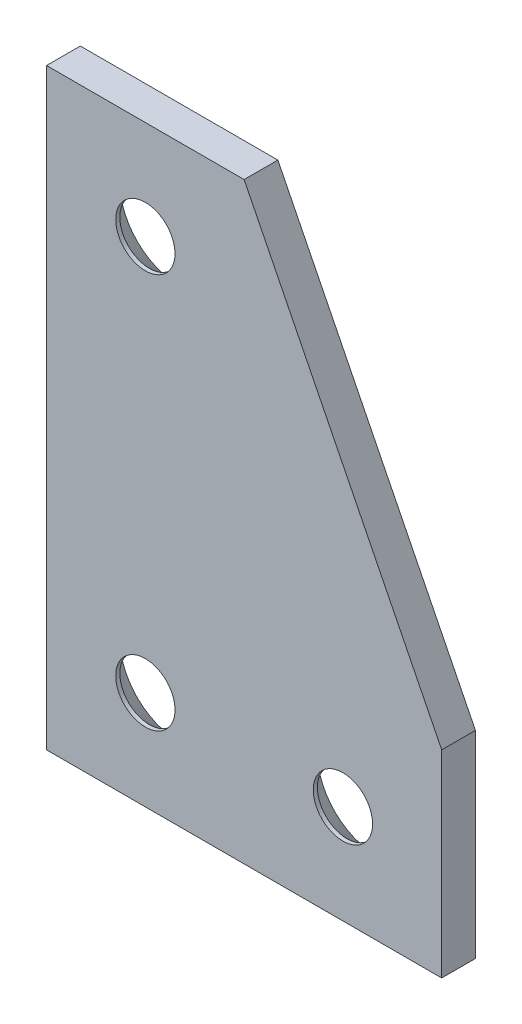
ISO-10303-21;
HEADER;
FILE_DESCRIPTION(('STEP AP214'),'2;1');
FILE_NAME('part.step','',(''),(''),'','','');
FILE_SCHEMA(('AUTOMOTIVE_DESIGN { 1 0 10303 214 1 1 1 1 }'));
ENDSEC;
DATA;
#1=APPLICATION_CONTEXT('core data for automotive mechanical design processes');
#2=APPLICATION_PROTOCOL_DEFINITION('international standard','automotive_design',2000,#1);
#3=PRODUCT_CONTEXT('',#1,'mechanical');
#4=PRODUCT('Part','Part','',(#3));
#5=PRODUCT_RELATED_PRODUCT_CATEGORY('part','',(#4));
#6=PRODUCT_DEFINITION_FORMATION('','',#4);
#7=PRODUCT_DEFINITION_CONTEXT('part definition',#1,'design');
#8=PRODUCT_DEFINITION('design','',#6,#7);
#9=PRODUCT_DEFINITION_SHAPE('','',#8);
#10=(LENGTH_UNIT() NAMED_UNIT(*) SI_UNIT(.MILLI.,.METRE.));
#11=(NAMED_UNIT(*) PLANE_ANGLE_UNIT() SI_UNIT($,.RADIAN.));
#12=(NAMED_UNIT(*) SI_UNIT($,.STERADIAN.) SOLID_ANGLE_UNIT());
#13=UNCERTAINTY_MEASURE_WITH_UNIT(LENGTH_MEASURE(1.E-05),#10,'distance_accuracy_value','');
#14=(GEOMETRIC_REPRESENTATION_CONTEXT(3) GLOBAL_UNCERTAINTY_ASSIGNED_CONTEXT((#13)) GLOBAL_UNIT_ASSIGNED_CONTEXT((#10,
#11,#12)) REPRESENTATION_CONTEXT('',''));
#15=CARTESIAN_POINT('',(0.,0.,0.));
#16=DIRECTION('',(0.,0.,1.));
#17=DIRECTION('',(1.,0.,0.));
#18=AXIS2_PLACEMENT_3D('',#15,#16,#17);
#19=CARTESIAN_POINT('',(0.,30.,-1.708));
#20=DIRECTION('',(-0.894427190999916,-0.447213595499958,0.));
#21=DIRECTION('',(0.447213595499958,-0.894427190999916,0.));
#22=AXIS2_PLACEMENT_3D('',#19,#20,#21);
#23=PLANE('',#22);
#24=DIRECTION('',(-0.447213595499958,0.894427190999916,0.));
#25=VECTOR('',#24,1.);
#26=CARTESIAN_POINT('',(0.,30.,1.708));
#27=LINE('',#26,#25);
#28=CARTESIAN_POINT('',(20.,-9.99999999999999,1.708));
#29=VERTEX_POINT('',#28);
#30=CARTESIAN_POINT('',(0.,30.,1.708));
#31=VERTEX_POINT('',#30);
#32=EDGE_CURVE('E118',#29,#31,#27,.T.);
#33=ORIENTED_EDGE('',*,*,#32,.F.);
#34=DIRECTION('',(0.,0.,1.));
#35=VECTOR('',#34,1.);
#36=CARTESIAN_POINT('',(20.,-9.99999999999999,-1.708));
#37=LINE('',#36,#35);
#38=CARTESIAN_POINT('',(20.,-9.99999999999999,-1.708));
#39=VERTEX_POINT('',#38);
#40=EDGE_CURVE('E117',#39,#29,#37,.T.);
#41=ORIENTED_EDGE('',*,*,#40,.F.);
#42=DIRECTION('',(-0.447213595499958,0.894427190999916,0.));
#43=VECTOR('',#42,1.);
#44=CARTESIAN_POINT('',(0.,30.,-1.708));
#45=LINE('',#44,#43);
#46=CARTESIAN_POINT('',(0.,30.,-1.708));
#47=VERTEX_POINT('',#46);
#48=EDGE_CURVE('E112',#39,#47,#45,.T.);
#49=ORIENTED_EDGE('',*,*,#48,.T.);
#50=DIRECTION('',(0.,0.,1.));
#51=VECTOR('',#50,1.);
#52=CARTESIAN_POINT('',(0.,30.,-1.708));
#53=LINE('',#52,#51);
#54=EDGE_CURVE('E131',#47,#31,#53,.T.);
#55=ORIENTED_EDGE('',*,*,#54,.T.);
#56=EDGE_LOOP('',(#33,#41,#49,#55));
#57=FACE_BOUND('',#56,.T.);
#58=ADVANCED_FACE('F41',(#57),#23,.F.);
#59=CARTESIAN_POINT('',(-20.,30.,-1.708));
#60=DIRECTION('',(0.,-1.,0.));
#61=DIRECTION('',(0.,0.,1.));
#62=AXIS2_PLACEMENT_3D('',#59,#60,#61);
#63=PLANE('',#62);
#64=DIRECTION('',(-1.,0.,0.));
#65=VECTOR('',#64,1.);
#66=CARTESIAN_POINT('',(-20.,30.,1.708));
#67=LINE('',#66,#65);
#68=CARTESIAN_POINT('',(-20.,30.,1.708));
#69=VERTEX_POINT('',#68);
#70=EDGE_CURVE('E120',#31,#69,#67,.T.);
#71=ORIENTED_EDGE('',*,*,#70,.F.);
#72=ORIENTED_EDGE('',*,*,#54,.F.);
#73=DIRECTION('',(-1.,0.,0.));
#74=VECTOR('',#73,1.);
#75=CARTESIAN_POINT('',(-20.,30.,-1.708));
#76=LINE('',#75,#74);
#77=CARTESIAN_POINT('',(-20.,30.,-1.708));
#78=VERTEX_POINT('',#77);
#79=EDGE_CURVE('E87',#47,#78,#76,.T.);
#80=ORIENTED_EDGE('',*,*,#79,.T.);
#81=DIRECTION('',(0.,0.,1.));
#82=VECTOR('',#81,1.);
#83=CARTESIAN_POINT('',(-20.,30.,-1.708));
#84=LINE('',#83,#82);
#85=EDGE_CURVE('E106',#78,#69,#84,.T.);
#86=ORIENTED_EDGE('',*,*,#85,.T.);
#87=EDGE_LOOP('',(#71,#72,#80,#86));
#88=FACE_BOUND('',#87,.T.);
#89=ADVANCED_FACE('F183',(#88),#63,.F.);
#90=CARTESIAN_POINT('',(-20.,-30.,-1.708));
#91=DIRECTION('',(1.,0.,0.));
#92=DIRECTION('',(0.,0.,1.));
#93=AXIS2_PLACEMENT_3D('',#90,#91,#92);
#94=PLANE('',#93);
#95=DIRECTION('',(0.,-1.,0.));
#96=VECTOR('',#95,1.);
#97=CARTESIAN_POINT('',(-20.,-30.,1.708));
#98=LINE('',#97,#96);
#99=CARTESIAN_POINT('',(-20.,-30.,1.708));
#100=VERTEX_POINT('',#99);
#101=EDGE_CURVE('E124',#69,#100,#98,.T.);
#102=ORIENTED_EDGE('',*,*,#101,.F.);
#103=ORIENTED_EDGE('',*,*,#85,.F.);
#104=DIRECTION('',(0.,-1.,0.));
#105=VECTOR('',#104,1.);
#106=CARTESIAN_POINT('',(-20.,-30.,-1.708));
#107=LINE('',#106,#105);
#108=CARTESIAN_POINT('',(-20.,-30.,-1.708));
#109=VERTEX_POINT('',#108);
#110=EDGE_CURVE('E96',#78,#109,#107,.T.);
#111=ORIENTED_EDGE('',*,*,#110,.T.);
#112=DIRECTION('',(0.,0.,1.));
#113=VECTOR('',#112,1.);
#114=CARTESIAN_POINT('',(-20.,-30.,-1.708));
#115=LINE('',#114,#113);
#116=EDGE_CURVE('E101',#109,#100,#115,.T.);
#117=ORIENTED_EDGE('',*,*,#116,.T.);
#118=EDGE_LOOP('',(#102,#103,#111,#117));
#119=FACE_BOUND('',#118,.T.);
#120=ADVANCED_FACE('F109',(#119),#94,.F.);
#121=CARTESIAN_POINT('',(-20.,-30.,-1.708));
#122=DIRECTION('',(0.,1.,0.));
#123=DIRECTION('',(-1.,0.,0.));
#124=AXIS2_PLACEMENT_3D('',#121,#122,#123);
#125=PLANE('',#124);
#126=DIRECTION('',(1.,0.,0.));
#127=VECTOR('',#126,1.);
#128=CARTESIAN_POINT('',(-20.,-30.,1.708));
#129=LINE('',#128,#127);
#130=CARTESIAN_POINT('',(20.,-30.,1.708));
#131=VERTEX_POINT('',#130);
#132=EDGE_CURVE('E103',#100,#131,#129,.T.);
#133=ORIENTED_EDGE('',*,*,#132,.F.);
#134=ORIENTED_EDGE('',*,*,#116,.F.);
#135=DIRECTION('',(1.,0.,0.));
#136=VECTOR('',#135,1.);
#137=CARTESIAN_POINT('',(-20.,-30.,-1.708));
#138=LINE('',#137,#136);
#139=CARTESIAN_POINT('',(20.,-30.,-1.708));
#140=VERTEX_POINT('',#139);
#141=EDGE_CURVE('E92',#109,#140,#138,.T.);
#142=ORIENTED_EDGE('',*,*,#141,.T.);
#143=DIRECTION('',(0.,0.,1.));
#144=VECTOR('',#143,1.);
#145=CARTESIAN_POINT('',(20.,-30.,-1.708));
#146=LINE('',#145,#144);
#147=EDGE_CURVE('E107',#140,#131,#146,.T.);
#148=ORIENTED_EDGE('',*,*,#147,.T.);
#149=EDGE_LOOP('',(#133,#134,#142,#148));
#150=FACE_BOUND('',#149,.T.);
#151=ADVANCED_FACE('F102',(#150),#125,.F.);
#152=CARTESIAN_POINT('',(20.,-30.,-1.708));
#153=DIRECTION('',(-1.,0.,0.));
#154=DIRECTION('',(0.,-1.,0.));
#155=AXIS2_PLACEMENT_3D('',#152,#153,#154);
#156=PLANE('',#155);
#157=DIRECTION('',(0.,1.,0.));
#158=VECTOR('',#157,1.);
#159=CARTESIAN_POINT('',(20.,-30.,1.708));
#160=LINE('',#159,#158);
#161=EDGE_CURVE('E75',#131,#29,#160,.T.);
#162=ORIENTED_EDGE('',*,*,#161,.F.);
#163=ORIENTED_EDGE('',*,*,#147,.F.);
#164=DIRECTION('',(0.,1.,0.));
#165=VECTOR('',#164,1.);
#166=CARTESIAN_POINT('',(20.,-30.,-1.708));
#167=LINE('',#166,#165);
#168=EDGE_CURVE('E58',#140,#39,#167,.T.);
#169=ORIENTED_EDGE('',*,*,#168,.T.);
#170=ORIENTED_EDGE('',*,*,#40,.T.);
#171=EDGE_LOOP('',(#162,#163,#169,#170));
#172=FACE_BOUND('',#171,.T.);
#173=ADVANCED_FACE('F170',(#172),#156,.F.);
#174=CARTESIAN_POINT('',(0.,0.,-1.708));
#175=DIRECTION('',(0.,0.,-1.));
#176=DIRECTION('',(1.,0.,0.));
#177=AXIS2_PLACEMENT_3D('',#174,#175,#176);
#178=PLANE('',#177);
#179=CARTESIAN_POINT('',(10.,-20.,-1.708));
#180=DIRECTION('',(0.,0.,1.));
#181=DIRECTION('',(1.,0.,0.));
#182=AXIS2_PLACEMENT_3D('',#179,#180,#181);
#183=CIRCLE('',#182,6.00000000000001);
#184=CARTESIAN_POINT('',(16.,-20.,-1.708));
#185=VERTEX_POINT('',#184);
#186=EDGE_CURVE('E143',#185,#185,#183,.F.);
#187=ORIENTED_EDGE('',*,*,#186,.F.);
#188=EDGE_LOOP('',(#187));
#189=FACE_BOUND('',#188,.T.);
#190=CARTESIAN_POINT('',(-9.99999999999999,-20.,-1.708));
#191=DIRECTION('',(0.,0.,1.));
#192=DIRECTION('',(1.,0.,0.));
#193=AXIS2_PLACEMENT_3D('',#190,#191,#192);
#194=CIRCLE('',#193,6.00000000000001);
#195=CARTESIAN_POINT('',(-3.99999999999998,-20.,-1.708));
#196=VERTEX_POINT('',#195);
#197=EDGE_CURVE('E140',#196,#196,#194,.F.);
#198=ORIENTED_EDGE('',*,*,#197,.F.);
#199=EDGE_LOOP('',(#198));
#200=FACE_BOUND('',#199,.T.);
#201=CARTESIAN_POINT('',(-10.,20.,-1.708));
#202=DIRECTION('',(0.,0.,1.));
#203=DIRECTION('',(1.,0.,0.));
#204=AXIS2_PLACEMENT_3D('',#201,#202,#203);
#205=CIRCLE('',#204,6.00000000000001);
#206=CARTESIAN_POINT('',(-3.99999999999999,20.,-1.708));
#207=VERTEX_POINT('',#206);
#208=EDGE_CURVE('E137',#207,#207,#205,.F.);
#209=ORIENTED_EDGE('',*,*,#208,.F.);
#210=EDGE_LOOP('',(#209));
#211=FACE_BOUND('',#210,.T.);
#212=ORIENTED_EDGE('',*,*,#48,.F.);
#213=ORIENTED_EDGE('',*,*,#168,.F.);
#214=ORIENTED_EDGE('',*,*,#141,.F.);
#215=ORIENTED_EDGE('',*,*,#110,.F.);
#216=ORIENTED_EDGE('',*,*,#79,.F.);
#217=EDGE_LOOP('',(#212,#213,#214,#215,#216));
#218=FACE_BOUND('',#217,.T.);
#219=ADVANCED_FACE('F94',(#189,#200,#211,#218),#178,.T.);
#220=CARTESIAN_POINT('',(0.,0.,1.708));
#221=DIRECTION('',(0.,0.,-1.));
#222=DIRECTION('',(1.,0.,0.));
#223=AXIS2_PLACEMENT_3D('',#220,#221,#222);
#224=PLANE('',#223);
#225=CARTESIAN_POINT('',(-10.,20.,1.708));
#226=DIRECTION('',(0.,0.,1.));
#227=DIRECTION('',(1.,0.,0.));
#228=AXIS2_PLACEMENT_3D('',#225,#226,#227);
#229=CIRCLE('',#228,3.);
#230=CARTESIAN_POINT('',(-7.,20.,1.708));
#231=VERTEX_POINT('',#230);
#232=EDGE_CURVE('E121',#231,#231,#229,.T.);
#233=ORIENTED_EDGE('',*,*,#232,.F.);
#234=EDGE_LOOP('',(#233));
#235=FACE_BOUND('',#234,.T.);
#236=CARTESIAN_POINT('',(-9.99999999999999,-20.,1.708));
#237=DIRECTION('',(0.,0.,1.));
#238=DIRECTION('',(1.,0.,0.));
#239=AXIS2_PLACEMENT_3D('',#236,#237,#238);
#240=CIRCLE('',#239,3.);
#241=CARTESIAN_POINT('',(-7.,-20.,1.708));
#242=VERTEX_POINT('',#241);
#243=EDGE_CURVE('E158',#242,#242,#240,.T.);
#244=ORIENTED_EDGE('',*,*,#243,.F.);
#245=EDGE_LOOP('',(#244));
#246=FACE_BOUND('',#245,.T.);
#247=CARTESIAN_POINT('',(10.,-20.,1.708));
#248=DIRECTION('',(0.,0.,1.));
#249=DIRECTION('',(1.,0.,0.));
#250=AXIS2_PLACEMENT_3D('',#247,#248,#249);
#251=CIRCLE('',#250,3.);
#252=CARTESIAN_POINT('',(13.,-20.,1.708));
#253=VERTEX_POINT('',#252);
#254=EDGE_CURVE('E160',#253,#253,#251,.T.);
#255=ORIENTED_EDGE('',*,*,#254,.F.);
#256=EDGE_LOOP('',(#255));
#257=FACE_BOUND('',#256,.T.);
#258=ORIENTED_EDGE('',*,*,#32,.T.);
#259=ORIENTED_EDGE('',*,*,#70,.T.);
#260=ORIENTED_EDGE('',*,*,#101,.T.);
#261=ORIENTED_EDGE('',*,*,#132,.T.);
#262=ORIENTED_EDGE('',*,*,#161,.T.);
#263=EDGE_LOOP('',(#258,#259,#260,#261,#262));
#264=FACE_BOUND('',#263,.T.);
#265=ADVANCED_FACE('F177',(#235,#246,#257,#264),#224,.F.);
#266=CARTESIAN_POINT('',(10.,-20.,1.708));
#267=DIRECTION('',(0.,0.,-1.));
#268=DIRECTION('',(1.,0.,0.));
#269=AXIS2_PLACEMENT_3D('',#266,#267,#268);
#270=CYLINDRICAL_SURFACE('',#269,3.);
#271=CARTESIAN_POINT('',(10.,-20.,1.292));
#272=DIRECTION('',(0.,0.,1.));
#273=DIRECTION('',(1.,0.,0.));
#274=AXIS2_PLACEMENT_3D('',#271,#272,#273);
#275=CIRCLE('',#274,3.);
#276=CARTESIAN_POINT('',(13.,-20.,1.292));
#277=VERTEX_POINT('',#276);
#278=EDGE_CURVE('E134',#277,#277,#275,.T.);
#279=ORIENTED_EDGE('',*,*,#278,.F.);
#280=EDGE_LOOP('',(#279));
#281=FACE_BOUND('',#280,.T.);
#282=ORIENTED_EDGE('',*,*,#254,.T.);
#283=EDGE_LOOP('',(#282));
#284=FACE_BOUND('',#283,.T.);
#285=ADVANCED_FACE('F154',(#281,#284),#270,.F.);
#286=CARTESIAN_POINT('',(-9.99999999999999,-20.,1.708));
#287=DIRECTION('',(0.,0.,-1.));
#288=DIRECTION('',(1.,0.,0.));
#289=AXIS2_PLACEMENT_3D('',#286,#287,#288);
#290=CYLINDRICAL_SURFACE('',#289,3.);
#291=CARTESIAN_POINT('',(-9.99999999999999,-20.,1.292));
#292=DIRECTION('',(0.,0.,1.));
#293=DIRECTION('',(1.,0.,0.));
#294=AXIS2_PLACEMENT_3D('',#291,#292,#293);
#295=CIRCLE('',#294,3.);
#296=CARTESIAN_POINT('',(-7.,-20.,1.292));
#297=VERTEX_POINT('',#296);
#298=EDGE_CURVE('E50',#297,#297,#295,.T.);
#299=ORIENTED_EDGE('',*,*,#298,.F.);
#300=EDGE_LOOP('',(#299));
#301=FACE_BOUND('',#300,.T.);
#302=ORIENTED_EDGE('',*,*,#243,.T.);
#303=EDGE_LOOP('',(#302));
#304=FACE_BOUND('',#303,.T.);
#305=ADVANCED_FACE('F150',(#301,#304),#290,.F.);
#306=CARTESIAN_POINT('',(-10.,20.,1.708));
#307=DIRECTION('',(0.,0.,-1.));
#308=DIRECTION('',(1.,0.,0.));
#309=AXIS2_PLACEMENT_3D('',#306,#307,#308);
#310=CYLINDRICAL_SURFACE('',#309,3.);
#311=CARTESIAN_POINT('',(-10.,20.,1.292));
#312=DIRECTION('',(0.,0.,1.));
#313=DIRECTION('',(1.,0.,0.));
#314=AXIS2_PLACEMENT_3D('',#311,#312,#313);
#315=CIRCLE('',#314,3.);
#316=CARTESIAN_POINT('',(-7.,20.,1.292));
#317=VERTEX_POINT('',#316);
#318=EDGE_CURVE('E11',#317,#317,#315,.T.);
#319=ORIENTED_EDGE('',*,*,#318,.F.);
#320=EDGE_LOOP('',(#319));
#321=FACE_BOUND('',#320,.T.);
#322=ORIENTED_EDGE('',*,*,#232,.T.);
#323=EDGE_LOOP('',(#322));
#324=FACE_BOUND('',#323,.T.);
#325=ADVANCED_FACE('F153',(#321,#324),#310,.F.);
#326=CARTESIAN_POINT('',(10.,-20.,1.292));
#327=DIRECTION('',(0.,0.,-1.));
#328=DIRECTION('',(1.,0.,0.));
#329=AXIS2_PLACEMENT_3D('',#326,#327,#328);
#330=CONICAL_SURFACE('',#329,3.,0.78539816339745);
#331=ORIENTED_EDGE('',*,*,#186,.T.);
#332=EDGE_LOOP('',(#331));
#333=FACE_BOUND('',#332,.T.);
#334=ORIENTED_EDGE('',*,*,#278,.T.);
#335=EDGE_LOOP('',(#334));
#336=FACE_BOUND('',#335,.T.);
#337=ADVANCED_FACE('F192',(#333,#336),#330,.F.);
#338=CARTESIAN_POINT('',(-9.99999999999999,-20.,1.292));
#339=DIRECTION('',(0.,0.,-1.));
#340=DIRECTION('',(1.,0.,0.));
#341=AXIS2_PLACEMENT_3D('',#338,#339,#340);
#342=CONICAL_SURFACE('',#341,3.,0.78539816339745);
#343=ORIENTED_EDGE('',*,*,#197,.T.);
#344=EDGE_LOOP('',(#343));
#345=FACE_BOUND('',#344,.T.);
#346=ORIENTED_EDGE('',*,*,#298,.T.);
#347=EDGE_LOOP('',(#346));
#348=FACE_BOUND('',#347,.T.);
#349=ADVANCED_FACE('F148',(#345,#348),#342,.F.);
#350=CARTESIAN_POINT('',(-10.,20.,1.292));
#351=DIRECTION('',(0.,0.,-1.));
#352=DIRECTION('',(1.,0.,0.));
#353=AXIS2_PLACEMENT_3D('',#350,#351,#352);
#354=CONICAL_SURFACE('',#353,3.,0.78539816339745);
#355=ORIENTED_EDGE('',*,*,#208,.T.);
#356=EDGE_LOOP('',(#355));
#357=FACE_BOUND('',#356,.T.);
#358=ORIENTED_EDGE('',*,*,#318,.T.);
#359=EDGE_LOOP('',(#358));
#360=FACE_BOUND('',#359,.T.);
#361=ADVANCED_FACE('F43',(#357,#360),#354,.F.);
#362=CLOSED_SHELL('',(#58,#89,#120,#151,#173,#219,#265,#285,#305,#325,#337,#349,#361));
#363=MANIFOLD_SOLID_BREP('B2',#362);
#364=ADVANCED_BREP_SHAPE_REPRESENTATION('',(#18,#363),#14);
#365=SHAPE_DEFINITION_REPRESENTATION(#9,#364);
ENDSEC;
END-ISO-10303-21;
